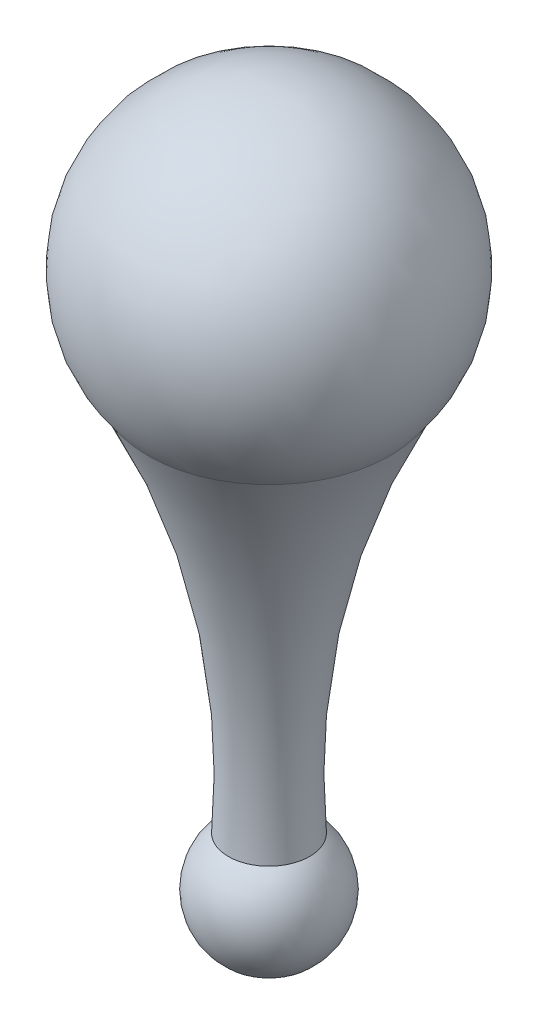
ISO-10303-21;
HEADER;
FILE_DESCRIPTION(('STEP AP214'),'2;1');
FILE_NAME('part.step','',(''),(''),'','','');
FILE_SCHEMA(('AUTOMOTIVE_DESIGN { 1 0 10303 214 1 1 1 1 }'));
ENDSEC;
DATA;
#1=APPLICATION_CONTEXT('core data for automotive mechanical design processes');
#2=APPLICATION_PROTOCOL_DEFINITION('international standard','automotive_design',2000,#1);
#3=PRODUCT_CONTEXT('',#1,'mechanical');
#4=PRODUCT('Part','Part','',(#3));
#5=PRODUCT_RELATED_PRODUCT_CATEGORY('part','',(#4));
#6=PRODUCT_DEFINITION_FORMATION('','',#4);
#7=PRODUCT_DEFINITION_CONTEXT('part definition',#1,'design');
#8=PRODUCT_DEFINITION('design','',#6,#7);
#9=PRODUCT_DEFINITION_SHAPE('','',#8);
#10=(LENGTH_UNIT() NAMED_UNIT(*) SI_UNIT(.MILLI.,.METRE.));
#11=(NAMED_UNIT(*) PLANE_ANGLE_UNIT() SI_UNIT($,.RADIAN.));
#12=(NAMED_UNIT(*) SI_UNIT($,.STERADIAN.) SOLID_ANGLE_UNIT());
#13=UNCERTAINTY_MEASURE_WITH_UNIT(LENGTH_MEASURE(1.E-05),#10,'distance_accuracy_value','');
#14=(GEOMETRIC_REPRESENTATION_CONTEXT(3) GLOBAL_UNCERTAINTY_ASSIGNED_CONTEXT((#13)) GLOBAL_UNIT_ASSIGNED_CONTEXT((#10,
#11,#12)) REPRESENTATION_CONTEXT('',''));
#15=CARTESIAN_POINT('',(0.,0.,0.));
#16=DIRECTION('',(0.,0.,1.));
#17=DIRECTION('',(1.,0.,0.));
#18=AXIS2_PLACEMENT_3D('',#15,#16,#17);
#19=CARTESIAN_POINT('',(0.,-351.559004184434,0.));
#20=DIRECTION('',(0.,1.,0.));
#21=DIRECTION('',(0.,0.,1.));
#22=AXIS2_PLACEMENT_3D('',#19,#20,#21);
#23=TOROIDAL_SURFACE('',#22,615.390092045247,584.2);
#24=CARTESIAN_POINT('',(0.,-81.6340264301904,0.));
#25=DIRECTION('',(0.,1.,0.));
#26=DIRECTION('',(0.,0.,1.));
#27=AXIS2_PLACEMENT_3D('',#24,#25,#26);
#28=CIRCLE('',#27,97.2876442761103);
#29=CARTESIAN_POINT('',(0.,-81.6340264301904,97.2876442761103));
#30=VERTEX_POINT('',#29);
#31=EDGE_CURVE('E48',#30,#30,#28,.T.);
#32=ORIENTED_EDGE('',*,*,#31,.F.);
#33=EDGE_LOOP('',(#32));
#34=FACE_BOUND('',#33,.T.);
#35=CARTESIAN_POINT('',(0.,-392.884942289556,0.));
#36=DIRECTION('',(0.,1.,0.));
#37=DIRECTION('',(0.,0.,1.));
#38=AXIS2_PLACEMENT_3D('',#35,#36,#37);
#39=CIRCLE('',#38,32.653610572076);
#40=CARTESIAN_POINT('',(0.,-392.884942289556,32.653610572076));
#41=VERTEX_POINT('',#40);
#42=EDGE_CURVE('E10',#41,#41,#39,.T.);
#43=ORIENTED_EDGE('',*,*,#42,.T.);
#44=EDGE_LOOP('',(#43));
#45=FACE_BOUND('',#44,.T.);
#46=ADVANCED_FACE('F41',(#34,#45),#23,.F.);
#47=CARTESIAN_POINT('',(0.,-431.8,0.));
#48=DIRECTION('',(0.,1.,0.));
#49=DIRECTION('',(-1.,0.,0.));
#50=AXIS2_PLACEMENT_3D('',#47,#48,#49);
#51=SPHERICAL_SURFACE('',#50,50.8);
#52=ORIENTED_EDGE('',*,*,#42,.F.);
#53=EDGE_LOOP('',(#52));
#54=FACE_BOUND('',#53,.T.);
#55=ADVANCED_FACE('F58',(#54),#51,.T.);
#56=CARTESIAN_POINT('',(0.,0.,0.));
#57=DIRECTION('',(0.,1.,0.));
#58=DIRECTION('',(1.,0.,0.));
#59=AXIS2_PLACEMENT_3D('',#56,#57,#58);
#60=SPHERICAL_SURFACE('',#59,127.);
#61=ORIENTED_EDGE('',*,*,#31,.T.);
#62=EDGE_LOOP('',(#61));
#63=FACE_BOUND('',#62,.T.);
#64=ADVANCED_FACE('F55',(#63),#60,.T.);
#65=CLOSED_SHELL('',(#46,#55,#64));
#66=MANIFOLD_SOLID_BREP('B2',#65);
#67=ADVANCED_BREP_SHAPE_REPRESENTATION('',(#18,#66),#14);
#68=SHAPE_DEFINITION_REPRESENTATION(#9,#67);
ENDSEC;
END-ISO-10303-21;
